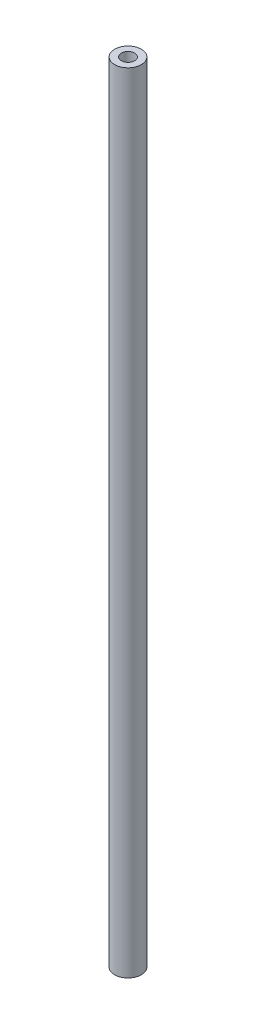
ISO-10303-21;
HEADER;
FILE_DESCRIPTION(('STEP AP214'),'2;1');
FILE_NAME('part.step','',(''),(''),'','','');
FILE_SCHEMA(('AUTOMOTIVE_DESIGN { 1 0 10303 214 1 1 1 1 }'));
ENDSEC;
DATA;
#1=APPLICATION_CONTEXT('core data for automotive mechanical design processes');
#2=APPLICATION_PROTOCOL_DEFINITION('international standard','automotive_design',2000,#1);
#3=PRODUCT_CONTEXT('',#1,'mechanical');
#4=PRODUCT('Part','Part','',(#3));
#5=PRODUCT_RELATED_PRODUCT_CATEGORY('part','',(#4));
#6=PRODUCT_DEFINITION_FORMATION('','',#4);
#7=PRODUCT_DEFINITION_CONTEXT('part definition',#1,'design');
#8=PRODUCT_DEFINITION('design','',#6,#7);
#9=PRODUCT_DEFINITION_SHAPE('','',#8);
#10=(LENGTH_UNIT() NAMED_UNIT(*) SI_UNIT(.MILLI.,.METRE.));
#11=(NAMED_UNIT(*) PLANE_ANGLE_UNIT() SI_UNIT($,.RADIAN.));
#12=(NAMED_UNIT(*) SI_UNIT($,.STERADIAN.) SOLID_ANGLE_UNIT());
#13=UNCERTAINTY_MEASURE_WITH_UNIT(LENGTH_MEASURE(1.E-05),#10,'distance_accuracy_value','');
#14=(GEOMETRIC_REPRESENTATION_CONTEXT(3) GLOBAL_UNCERTAINTY_ASSIGNED_CONTEXT((#13)) GLOBAL_UNIT_ASSIGNED_CONTEXT((#10,
#11,#12)) REPRESENTATION_CONTEXT('',''));
#15=CARTESIAN_POINT('',(0.,0.,0.));
#16=DIRECTION('',(0.,0.,1.));
#17=DIRECTION('',(1.,0.,0.));
#18=AXIS2_PLACEMENT_3D('',#15,#16,#17);
#19=CARTESIAN_POINT('',(0.,374.65,0.));
#20=DIRECTION('',(0.,1.,0.));
#21=DIRECTION('',(0.,0.,1.));
#22=AXIS2_PLACEMENT_3D('',#19,#20,#21);
#23=PLANE('',#22);
#24=CARTESIAN_POINT('',(0.,374.65,0.));
#25=DIRECTION('',(0.,1.,0.));
#26=DIRECTION('',(0.,0.,1.));
#27=AXIS2_PLACEMENT_3D('',#24,#25,#26);
#28=CIRCLE('',#27,6.35);
#29=CARTESIAN_POINT('',(0.,374.65,6.35));
#30=VERTEX_POINT('',#29);
#31=EDGE_CURVE('E10',#30,#30,#28,.T.);
#32=ORIENTED_EDGE('',*,*,#31,.T.);
#33=EDGE_LOOP('',(#32));
#34=FACE_BOUND('',#33,.T.);
#35=CARTESIAN_POINT('',(0.,374.65,0.));
#36=DIRECTION('',(0.,1.,0.));
#37=DIRECTION('',(0.,0.,1.));
#38=AXIS2_PLACEMENT_3D('',#35,#36,#37);
#39=CIRCLE('',#38,3.175);
#40=CARTESIAN_POINT('',(0.,374.65,3.175));
#41=VERTEX_POINT('',#40);
#42=EDGE_CURVE('E42',#41,#41,#39,.T.);
#43=ORIENTED_EDGE('',*,*,#42,.F.);
#44=EDGE_LOOP('',(#43));
#45=FACE_BOUND('',#44,.T.);
#46=ADVANCED_FACE('F31',(#34,#45),#23,.T.);
#47=CARTESIAN_POINT('',(0.,0.,0.));
#48=DIRECTION('',(0.,1.,0.));
#49=DIRECTION('',(0.,0.,1.));
#50=AXIS2_PLACEMENT_3D('',#47,#48,#49);
#51=PLANE('',#50);
#52=CARTESIAN_POINT('',(0.,0.,0.));
#53=DIRECTION('',(0.,1.,0.));
#54=DIRECTION('',(0.,0.,1.));
#55=AXIS2_PLACEMENT_3D('',#52,#53,#54);
#56=CIRCLE('',#55,6.35);
#57=CARTESIAN_POINT('',(0.,0.,6.35));
#58=VERTEX_POINT('',#57);
#59=EDGE_CURVE('E35',#58,#58,#56,.T.);
#60=ORIENTED_EDGE('',*,*,#59,.F.);
#61=EDGE_LOOP('',(#60));
#62=FACE_BOUND('',#61,.T.);
#63=CARTESIAN_POINT('',(0.,0.,0.));
#64=DIRECTION('',(0.,1.,0.));
#65=DIRECTION('',(0.,0.,1.));
#66=AXIS2_PLACEMENT_3D('',#63,#64,#65);
#67=CIRCLE('',#66,3.175);
#68=CARTESIAN_POINT('',(0.,0.,3.175));
#69=VERTEX_POINT('',#68);
#70=EDGE_CURVE('E44',#69,#69,#67,.T.);
#71=ORIENTED_EDGE('',*,*,#70,.T.);
#72=EDGE_LOOP('',(#71));
#73=FACE_BOUND('',#72,.T.);
#74=ADVANCED_FACE('F54',(#62,#73),#51,.F.);
#75=CARTESIAN_POINT('',(0.,374.65,0.));
#76=DIRECTION('',(0.,-1.,0.));
#77=DIRECTION('',(0.,0.,-1.));
#78=AXIS2_PLACEMENT_3D('',#75,#76,#77);
#79=CYLINDRICAL_SURFACE('',#78,6.35);
#80=ORIENTED_EDGE('',*,*,#31,.F.);
#81=EDGE_LOOP('',(#80));
#82=FACE_BOUND('',#81,.T.);
#83=ORIENTED_EDGE('',*,*,#59,.T.);
#84=EDGE_LOOP('',(#83));
#85=FACE_BOUND('',#84,.T.);
#86=ADVANCED_FACE('F33',(#82,#85),#79,.T.);
#87=CARTESIAN_POINT('',(0.,374.65,0.));
#88=DIRECTION('',(0.,-1.,0.));
#89=DIRECTION('',(0.,0.,-1.));
#90=AXIS2_PLACEMENT_3D('',#87,#88,#89);
#91=CYLINDRICAL_SURFACE('',#90,3.175);
#92=ORIENTED_EDGE('',*,*,#42,.T.);
#93=EDGE_LOOP('',(#92));
#94=FACE_BOUND('',#93,.T.);
#95=ORIENTED_EDGE('',*,*,#70,.F.);
#96=EDGE_LOOP('',(#95));
#97=FACE_BOUND('',#96,.T.);
#98=ADVANCED_FACE('F50',(#94,#97),#91,.F.);
#99=CLOSED_SHELL('',(#46,#74,#86,#98));
#100=MANIFOLD_SOLID_BREP('B2',#99);
#101=ADVANCED_BREP_SHAPE_REPRESENTATION('',(#18,#100),#14);
#102=SHAPE_DEFINITION_REPRESENTATION(#9,#101);
ENDSEC;
END-ISO-10303-21;
